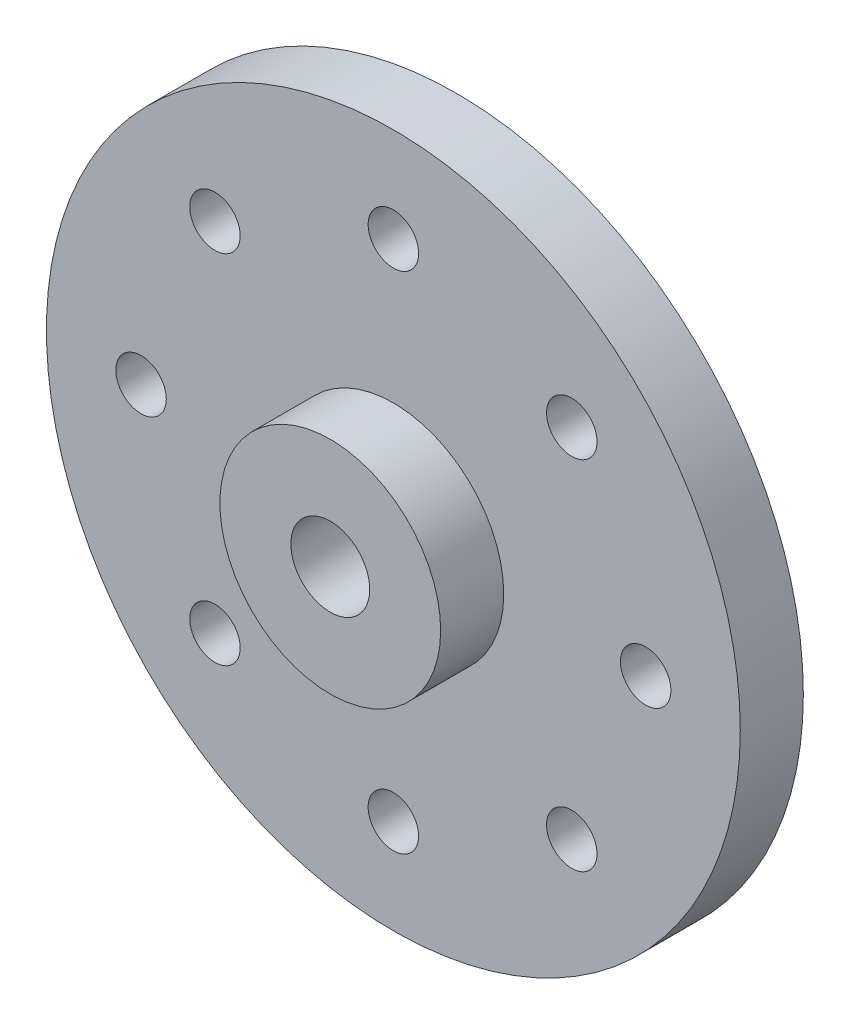
ISO-10303-21;
HEADER;
FILE_DESCRIPTION(('STEP AP214'),'2;1');
FILE_NAME('part.step','',(''),(''),'','','');
FILE_SCHEMA(('AUTOMOTIVE_DESIGN { 1 0 10303 214 1 1 1 1 }'));
ENDSEC;
DATA;
#1=APPLICATION_CONTEXT('core data for automotive mechanical design processes');
#2=APPLICATION_PROTOCOL_DEFINITION('international standard','automotive_design',2000,#1);
#3=PRODUCT_CONTEXT('',#1,'mechanical');
#4=PRODUCT('Part','Part','',(#3));
#5=PRODUCT_RELATED_PRODUCT_CATEGORY('part','',(#4));
#6=PRODUCT_DEFINITION_FORMATION('','',#4);
#7=PRODUCT_DEFINITION_CONTEXT('part definition',#1,'design');
#8=PRODUCT_DEFINITION('design','',#6,#7);
#9=PRODUCT_DEFINITION_SHAPE('','',#8);
#10=(LENGTH_UNIT() NAMED_UNIT(*) SI_UNIT(.MILLI.,.METRE.));
#11=(NAMED_UNIT(*) PLANE_ANGLE_UNIT() SI_UNIT($,.RADIAN.));
#12=(NAMED_UNIT(*) SI_UNIT($,.STERADIAN.) SOLID_ANGLE_UNIT());
#13=UNCERTAINTY_MEASURE_WITH_UNIT(LENGTH_MEASURE(1.E-05),#10,'distance_accuracy_value','');
#14=(GEOMETRIC_REPRESENTATION_CONTEXT(3) GLOBAL_UNCERTAINTY_ASSIGNED_CONTEXT((#13)) GLOBAL_UNIT_ASSIGNED_CONTEXT((#10,
#11,#12)) REPRESENTATION_CONTEXT('',''));
#15=CARTESIAN_POINT('',(0.,0.,0.));
#16=DIRECTION('',(0.,0.,1.));
#17=DIRECTION('',(1.,0.,0.));
#18=AXIS2_PLACEMENT_3D('',#15,#16,#17);
#19=CARTESIAN_POINT('',(0.,0.,0.));
#20=DIRECTION('',(0.,0.,1.));
#21=DIRECTION('',(1.,0.,0.));
#22=AXIS2_PLACEMENT_3D('',#19,#20,#21);
#23=PLANE('',#22);
#24=CARTESIAN_POINT('',(0.,0.,0.));
#25=DIRECTION('',(0.,0.,1.));
#26=DIRECTION('',(1.,0.,0.));
#27=AXIS2_PLACEMENT_3D('',#24,#25,#26);
#28=CIRCLE('',#27,11.);
#29=CARTESIAN_POINT('',(11.,0.,0.));
#30=VERTEX_POINT('',#29);
#31=EDGE_CURVE('E66',#30,#30,#28,.T.);
#32=ORIENTED_EDGE('',*,*,#31,.F.);
#33=EDGE_LOOP('',(#32));
#34=FACE_BOUND('',#33,.T.);
#35=CARTESIAN_POINT('',(5.65685424949239,5.65685424949237,0.));
#36=DIRECTION('',(0.,0.,1.));
#37=DIRECTION('',(1.,0.,0.));
#38=AXIS2_PLACEMENT_3D('',#35,#36,#37);
#39=CIRCLE('',#38,0.799999999999989);
#40=CARTESIAN_POINT('',(6.45685424949238,5.65685424949237,0.));
#41=VERTEX_POINT('',#40);
#42=EDGE_CURVE('E79',#41,#41,#39,.T.);
#43=ORIENTED_EDGE('',*,*,#42,.T.);
#44=EDGE_LOOP('',(#43));
#45=FACE_BOUND('',#44,.T.);
#46=CARTESIAN_POINT('',(8.,0.,0.));
#47=DIRECTION('',(0.,0.,1.));
#48=DIRECTION('',(1.,0.,0.));
#49=AXIS2_PLACEMENT_3D('',#46,#47,#48);
#50=CIRCLE('',#49,0.799999999999989);
#51=CARTESIAN_POINT('',(8.79999999999999,0.,0.));
#52=VERTEX_POINT('',#51);
#53=EDGE_CURVE('E145',#52,#52,#50,.T.);
#54=ORIENTED_EDGE('',*,*,#53,.T.);
#55=EDGE_LOOP('',(#54));
#56=FACE_BOUND('',#55,.T.);
#57=CARTESIAN_POINT('',(5.65685424949235,-5.65685424949241,0.));
#58=DIRECTION('',(0.,0.,1.));
#59=DIRECTION('',(1.,0.,0.));
#60=AXIS2_PLACEMENT_3D('',#57,#58,#59);
#61=CIRCLE('',#60,0.799999999999989);
#62=CARTESIAN_POINT('',(6.45685424949234,-5.65685424949241,0.));
#63=VERTEX_POINT('',#62);
#64=EDGE_CURVE('E84',#63,#63,#61,.T.);
#65=ORIENTED_EDGE('',*,*,#64,.T.);
#66=EDGE_LOOP('',(#65));
#67=FACE_BOUND('',#66,.T.);
#68=CARTESIAN_POINT('',(0.,-8.,0.));
#69=DIRECTION('',(0.,0.,1.));
#70=DIRECTION('',(1.,0.,0.));
#71=AXIS2_PLACEMENT_3D('',#68,#69,#70);
#72=CIRCLE('',#71,0.799999999999989);
#73=CARTESIAN_POINT('',(0.799999999999933,-8.,0.));
#74=VERTEX_POINT('',#73);
#75=EDGE_CURVE('E135',#74,#74,#72,.T.);
#76=ORIENTED_EDGE('',*,*,#75,.T.);
#77=EDGE_LOOP('',(#76));
#78=FACE_BOUND('',#77,.T.);
#79=CARTESIAN_POINT('',(-5.65685424949243,-5.65685424949233,0.));
#80=DIRECTION('',(0.,0.,1.));
#81=DIRECTION('',(1.,0.,0.));
#82=AXIS2_PLACEMENT_3D('',#79,#80,#81);
#83=CIRCLE('',#82,0.799999999999989);
#84=CARTESIAN_POINT('',(-4.85685424949244,-5.65685424949233,0.));
#85=VERTEX_POINT('',#84);
#86=EDGE_CURVE('E90',#85,#85,#83,.T.);
#87=ORIENTED_EDGE('',*,*,#86,.T.);
#88=EDGE_LOOP('',(#87));
#89=FACE_BOUND('',#88,.T.);
#90=CARTESIAN_POINT('',(-8.,0.,0.));
#91=DIRECTION('',(0.,0.,1.));
#92=DIRECTION('',(1.,0.,0.));
#93=AXIS2_PLACEMENT_3D('',#90,#91,#92);
#94=CIRCLE('',#93,0.799999999999989);
#95=CARTESIAN_POINT('',(-7.20000000000001,0.,0.));
#96=VERTEX_POINT('',#95);
#97=EDGE_CURVE('E95',#96,#96,#94,.T.);
#98=ORIENTED_EDGE('',*,*,#97,.T.);
#99=EDGE_LOOP('',(#98));
#100=FACE_BOUND('',#99,.T.);
#101=CARTESIAN_POINT('',(-5.65685424949231,5.65685424949245,0.));
#102=DIRECTION('',(0.,0.,1.));
#103=DIRECTION('',(1.,0.,0.));
#104=AXIS2_PLACEMENT_3D('',#101,#102,#103);
#105=CIRCLE('',#104,0.799999999999989);
#106=CARTESIAN_POINT('',(-4.85685424949232,5.65685424949245,0.));
#107=VERTEX_POINT('',#106);
#108=EDGE_CURVE('E100',#107,#107,#105,.T.);
#109=ORIENTED_EDGE('',*,*,#108,.T.);
#110=EDGE_LOOP('',(#109));
#111=FACE_BOUND('',#110,.T.);
#112=CARTESIAN_POINT('',(0.,8.,0.));
#113=DIRECTION('',(0.,0.,1.));
#114=DIRECTION('',(1.,0.,0.));
#115=AXIS2_PLACEMENT_3D('',#112,#113,#114);
#116=CIRCLE('',#115,0.799999999999989);
#117=CARTESIAN_POINT('',(0.799999999999989,8.,0.));
#118=VERTEX_POINT('',#117);
#119=EDGE_CURVE('E104',#118,#118,#116,.T.);
#120=ORIENTED_EDGE('',*,*,#119,.T.);
#121=EDGE_LOOP('',(#120));
#122=FACE_BOUND('',#121,.T.);
#123=CARTESIAN_POINT('',(0.,0.,0.));
#124=DIRECTION('',(0.,0.,1.));
#125=DIRECTION('',(1.,0.,0.));
#126=AXIS2_PLACEMENT_3D('',#123,#124,#125);
#127=CIRCLE('',#126,2.);
#128=CARTESIAN_POINT('',(2.,0.,0.));
#129=VERTEX_POINT('',#128);
#130=EDGE_CURVE('E12',#129,#129,#127,.F.);
#131=ORIENTED_EDGE('',*,*,#130,.F.);
#132=EDGE_LOOP('',(#131));
#133=FACE_BOUND('',#132,.T.);
#134=ADVANCED_FACE('F52',(#34,#45,#56,#67,#78,#89,#100,#111,#122,#133),#23,.F.);
#135=CARTESIAN_POINT('',(0.,0.,2.));
#136=DIRECTION('',(0.,0.,1.));
#137=DIRECTION('',(1.,0.,0.));
#138=AXIS2_PLACEMENT_3D('',#135,#136,#137);
#139=PLANE('',#138);
#140=CARTESIAN_POINT('',(0.,8.,2.));
#141=DIRECTION('',(0.,0.,1.));
#142=DIRECTION('',(1.,0.,0.));
#143=AXIS2_PLACEMENT_3D('',#140,#141,#142);
#144=CIRCLE('',#143,0.79999999999999);
#145=CARTESIAN_POINT('',(0.79999999999999,8.,2.));
#146=VERTEX_POINT('',#145);
#147=EDGE_CURVE('E107',#146,#146,#144,.T.);
#148=ORIENTED_EDGE('',*,*,#147,.F.);
#149=EDGE_LOOP('',(#148));
#150=FACE_BOUND('',#149,.T.);
#151=CARTESIAN_POINT('',(-5.65685424949231,5.65685424949245,2.));
#152=DIRECTION('',(0.,0.,1.));
#153=DIRECTION('',(1.,0.,0.));
#154=AXIS2_PLACEMENT_3D('',#151,#152,#153);
#155=CIRCLE('',#154,0.79999999999999);
#156=CARTESIAN_POINT('',(-4.85685424949232,5.65685424949245,2.));
#157=VERTEX_POINT('',#156);
#158=EDGE_CURVE('E103',#157,#157,#155,.T.);
#159=ORIENTED_EDGE('',*,*,#158,.F.);
#160=EDGE_LOOP('',(#159));
#161=FACE_BOUND('',#160,.T.);
#162=CARTESIAN_POINT('',(-8.,0.,2.));
#163=DIRECTION('',(0.,0.,1.));
#164=DIRECTION('',(1.,0.,0.));
#165=AXIS2_PLACEMENT_3D('',#162,#163,#164);
#166=CIRCLE('',#165,0.79999999999999);
#167=CARTESIAN_POINT('',(-7.20000000000001,0.,2.));
#168=VERTEX_POINT('',#167);
#169=EDGE_CURVE('E99',#168,#168,#166,.T.);
#170=ORIENTED_EDGE('',*,*,#169,.F.);
#171=EDGE_LOOP('',(#170));
#172=FACE_BOUND('',#171,.T.);
#173=CARTESIAN_POINT('',(-5.65685424949243,-5.65685424949233,2.));
#174=DIRECTION('',(0.,0.,1.));
#175=DIRECTION('',(1.,0.,0.));
#176=AXIS2_PLACEMENT_3D('',#173,#174,#175);
#177=CIRCLE('',#176,0.79999999999999);
#178=CARTESIAN_POINT('',(-4.85685424949244,-5.65685424949233,2.));
#179=VERTEX_POINT('',#178);
#180=EDGE_CURVE('E94',#179,#179,#177,.T.);
#181=ORIENTED_EDGE('',*,*,#180,.F.);
#182=EDGE_LOOP('',(#181));
#183=FACE_BOUND('',#182,.T.);
#184=CARTESIAN_POINT('',(0.,-8.,2.));
#185=DIRECTION('',(0.,0.,1.));
#186=DIRECTION('',(1.,0.,0.));
#187=AXIS2_PLACEMENT_3D('',#184,#185,#186);
#188=CIRCLE('',#187,0.79999999999999);
#189=CARTESIAN_POINT('',(0.799999999999934,-8.,2.));
#190=VERTEX_POINT('',#189);
#191=EDGE_CURVE('E93',#190,#190,#188,.T.);
#192=ORIENTED_EDGE('',*,*,#191,.F.);
#193=EDGE_LOOP('',(#192));
#194=FACE_BOUND('',#193,.T.);
#195=CARTESIAN_POINT('',(5.65685424949235,-5.65685424949241,2.));
#196=DIRECTION('',(0.,0.,1.));
#197=DIRECTION('',(1.,0.,0.));
#198=AXIS2_PLACEMENT_3D('',#195,#196,#197);
#199=CIRCLE('',#198,0.79999999999999);
#200=CARTESIAN_POINT('',(6.45685424949234,-5.65685424949241,2.));
#201=VERTEX_POINT('',#200);
#202=EDGE_CURVE('E89',#201,#201,#199,.T.);
#203=ORIENTED_EDGE('',*,*,#202,.F.);
#204=EDGE_LOOP('',(#203));
#205=FACE_BOUND('',#204,.T.);
#206=CARTESIAN_POINT('',(8.,0.,2.));
#207=DIRECTION('',(0.,0.,1.));
#208=DIRECTION('',(1.,0.,0.));
#209=AXIS2_PLACEMENT_3D('',#206,#207,#208);
#210=CIRCLE('',#209,0.79999999999999);
#211=CARTESIAN_POINT('',(8.79999999999999,0.,2.));
#212=VERTEX_POINT('',#211);
#213=EDGE_CURVE('E88',#212,#212,#210,.T.);
#214=ORIENTED_EDGE('',*,*,#213,.F.);
#215=EDGE_LOOP('',(#214));
#216=FACE_BOUND('',#215,.T.);
#217=CARTESIAN_POINT('',(5.65685424949239,5.65685424949237,2.));
#218=DIRECTION('',(0.,0.,1.));
#219=DIRECTION('',(1.,0.,0.));
#220=AXIS2_PLACEMENT_3D('',#217,#218,#219);
#221=CIRCLE('',#220,0.79999999999999);
#222=CARTESIAN_POINT('',(6.45685424949238,5.65685424949237,2.));
#223=VERTEX_POINT('',#222);
#224=EDGE_CURVE('E83',#223,#223,#221,.T.);
#225=ORIENTED_EDGE('',*,*,#224,.F.);
#226=EDGE_LOOP('',(#225));
#227=FACE_BOUND('',#226,.T.);
#228=CARTESIAN_POINT('',(0.,0.,2.));
#229=DIRECTION('',(0.,0.,1.));
#230=DIRECTION('',(1.,0.,0.));
#231=AXIS2_PLACEMENT_3D('',#228,#229,#230);
#232=CIRCLE('',#231,11.);
#233=CARTESIAN_POINT('',(11.,0.,2.));
#234=VERTEX_POINT('',#233);
#235=EDGE_CURVE('E60',#234,#234,#232,.T.);
#236=ORIENTED_EDGE('',*,*,#235,.T.);
#237=EDGE_LOOP('',(#236));
#238=FACE_BOUND('',#237,.T.);
#239=CARTESIAN_POINT('',(0.,0.,2.));
#240=DIRECTION('',(0.,0.,1.));
#241=DIRECTION('',(1.,0.,0.));
#242=AXIS2_PLACEMENT_3D('',#239,#240,#241);
#243=CIRCLE('',#242,3.5);
#244=CARTESIAN_POINT('',(3.5,0.,2.));
#245=VERTEX_POINT('',#244);
#246=EDGE_CURVE('E76',#245,#245,#243,.T.);
#247=ORIENTED_EDGE('',*,*,#246,.F.);
#248=EDGE_LOOP('',(#247));
#249=FACE_BOUND('',#248,.T.);
#250=ADVANCED_FACE('F160',(#150,#161,#172,#183,#194,#205,#216,#227,#238,#249),#139,.T.);
#251=CARTESIAN_POINT('',(0.,0.,2.));
#252=DIRECTION('',(0.,0.,-1.));
#253=DIRECTION('',(-1.,0.,0.));
#254=AXIS2_PLACEMENT_3D('',#251,#252,#253);
#255=CYLINDRICAL_SURFACE('',#254,11.);
#256=ORIENTED_EDGE('',*,*,#235,.F.);
#257=EDGE_LOOP('',(#256));
#258=FACE_BOUND('',#257,.T.);
#259=ORIENTED_EDGE('',*,*,#31,.T.);
#260=EDGE_LOOP('',(#259));
#261=FACE_BOUND('',#260,.T.);
#262=ADVANCED_FACE('F54',(#258,#261),#255,.T.);
#263=CARTESIAN_POINT('',(0.,0.,4.));
#264=DIRECTION('',(0.,0.,-1.));
#265=DIRECTION('',(-1.,0.,0.));
#266=AXIS2_PLACEMENT_3D('',#263,#264,#265);
#267=CYLINDRICAL_SURFACE('',#266,3.5);
#268=CARTESIAN_POINT('',(0.,0.,4.));
#269=DIRECTION('',(0.,0.,1.));
#270=DIRECTION('',(1.,0.,0.));
#271=AXIS2_PLACEMENT_3D('',#268,#269,#270);
#272=CIRCLE('',#271,3.5);
#273=CARTESIAN_POINT('',(3.5,0.,4.));
#274=VERTEX_POINT('',#273);
#275=EDGE_CURVE('E73',#274,#274,#272,.T.);
#276=ORIENTED_EDGE('',*,*,#275,.F.);
#277=EDGE_LOOP('',(#276));
#278=FACE_BOUND('',#277,.T.);
#279=ORIENTED_EDGE('',*,*,#246,.T.);
#280=EDGE_LOOP('',(#279));
#281=FACE_BOUND('',#280,.T.);
#282=ADVANCED_FACE('F158',(#278,#281),#267,.T.);
#283=CARTESIAN_POINT('',(0.,0.,4.));
#284=DIRECTION('',(0.,0.,1.));
#285=DIRECTION('',(1.,0.,0.));
#286=AXIS2_PLACEMENT_3D('',#283,#284,#285);
#287=PLANE('',#286);
#288=CARTESIAN_POINT('',(0.,0.,4.));
#289=DIRECTION('',(0.,0.,1.));
#290=DIRECTION('',(1.,0.,0.));
#291=AXIS2_PLACEMENT_3D('',#288,#289,#290);
#292=CIRCLE('',#291,1.25);
#293=CARTESIAN_POINT('',(1.25,0.,4.));
#294=VERTEX_POINT('',#293);
#295=EDGE_CURVE('E228',#294,#294,#292,.T.);
#296=ORIENTED_EDGE('',*,*,#295,.F.);
#297=EDGE_LOOP('',(#296));
#298=FACE_BOUND('',#297,.T.);
#299=ORIENTED_EDGE('',*,*,#275,.T.);
#300=EDGE_LOOP('',(#299));
#301=FACE_BOUND('',#300,.T.);
#302=ADVANCED_FACE('F174',(#298,#301),#287,.T.);
#303=CARTESIAN_POINT('',(5.65685424949239,5.65685424949237,2.));
#304=DIRECTION('',(0.,0.,1.));
#305=DIRECTION('',(1.,0.,0.));
#306=AXIS2_PLACEMENT_3D('',#303,#304,#305);
#307=CYLINDRICAL_SURFACE('',#306,0.799999999999989);
#308=ORIENTED_EDGE('',*,*,#224,.T.);
#309=EDGE_LOOP('',(#308));
#310=FACE_BOUND('',#309,.T.);
#311=ORIENTED_EDGE('',*,*,#42,.F.);
#312=EDGE_LOOP('',(#311));
#313=FACE_BOUND('',#312,.T.);
#314=ADVANCED_FACE('F178',(#310,#313),#307,.F.);
#315=CARTESIAN_POINT('',(8.,0.,2.));
#316=DIRECTION('',(0.,0.,1.));
#317=DIRECTION('',(1.,0.,0.));
#318=AXIS2_PLACEMENT_3D('',#315,#316,#317);
#319=CYLINDRICAL_SURFACE('',#318,0.799999999999989);
#320=ORIENTED_EDGE('',*,*,#213,.T.);
#321=EDGE_LOOP('',(#320));
#322=FACE_BOUND('',#321,.T.);
#323=ORIENTED_EDGE('',*,*,#53,.F.);
#324=EDGE_LOOP('',(#323));
#325=FACE_BOUND('',#324,.T.);
#326=ADVANCED_FACE('F182',(#322,#325),#319,.F.);
#327=CARTESIAN_POINT('',(5.65685424949235,-5.65685424949241,2.));
#328=DIRECTION('',(0.,0.,1.));
#329=DIRECTION('',(1.,0.,0.));
#330=AXIS2_PLACEMENT_3D('',#327,#328,#329);
#331=CYLINDRICAL_SURFACE('',#330,0.799999999999989);
#332=ORIENTED_EDGE('',*,*,#202,.T.);
#333=EDGE_LOOP('',(#332));
#334=FACE_BOUND('',#333,.T.);
#335=ORIENTED_EDGE('',*,*,#64,.F.);
#336=EDGE_LOOP('',(#335));
#337=FACE_BOUND('',#336,.T.);
#338=ADVANCED_FACE('F186',(#334,#337),#331,.F.);
#339=CARTESIAN_POINT('',(0.,-8.,2.));
#340=DIRECTION('',(0.,0.,1.));
#341=DIRECTION('',(1.,0.,0.));
#342=AXIS2_PLACEMENT_3D('',#339,#340,#341);
#343=CYLINDRICAL_SURFACE('',#342,0.799999999999989);
#344=ORIENTED_EDGE('',*,*,#191,.T.);
#345=EDGE_LOOP('',(#344));
#346=FACE_BOUND('',#345,.T.);
#347=ORIENTED_EDGE('',*,*,#75,.F.);
#348=EDGE_LOOP('',(#347));
#349=FACE_BOUND('',#348,.T.);
#350=ADVANCED_FACE('F190',(#346,#349),#343,.F.);
#351=CARTESIAN_POINT('',(-5.65685424949243,-5.65685424949233,2.));
#352=DIRECTION('',(0.,0.,1.));
#353=DIRECTION('',(1.,0.,0.));
#354=AXIS2_PLACEMENT_3D('',#351,#352,#353);
#355=CYLINDRICAL_SURFACE('',#354,0.799999999999989);
#356=ORIENTED_EDGE('',*,*,#180,.T.);
#357=EDGE_LOOP('',(#356));
#358=FACE_BOUND('',#357,.T.);
#359=ORIENTED_EDGE('',*,*,#86,.F.);
#360=EDGE_LOOP('',(#359));
#361=FACE_BOUND('',#360,.T.);
#362=ADVANCED_FACE('F194',(#358,#361),#355,.F.);
#363=CARTESIAN_POINT('',(-8.,0.,2.));
#364=DIRECTION('',(0.,0.,1.));
#365=DIRECTION('',(1.,0.,0.));
#366=AXIS2_PLACEMENT_3D('',#363,#364,#365);
#367=CYLINDRICAL_SURFACE('',#366,0.799999999999989);
#368=ORIENTED_EDGE('',*,*,#169,.T.);
#369=EDGE_LOOP('',(#368));
#370=FACE_BOUND('',#369,.T.);
#371=ORIENTED_EDGE('',*,*,#97,.F.);
#372=EDGE_LOOP('',(#371));
#373=FACE_BOUND('',#372,.T.);
#374=ADVANCED_FACE('F198',(#370,#373),#367,.F.);
#375=CARTESIAN_POINT('',(-5.65685424949231,5.65685424949245,2.));
#376=DIRECTION('',(0.,0.,1.));
#377=DIRECTION('',(1.,0.,0.));
#378=AXIS2_PLACEMENT_3D('',#375,#376,#377);
#379=CYLINDRICAL_SURFACE('',#378,0.799999999999989);
#380=ORIENTED_EDGE('',*,*,#158,.T.);
#381=EDGE_LOOP('',(#380));
#382=FACE_BOUND('',#381,.T.);
#383=ORIENTED_EDGE('',*,*,#108,.F.);
#384=EDGE_LOOP('',(#383));
#385=FACE_BOUND('',#384,.T.);
#386=ADVANCED_FACE('F202',(#382,#385),#379,.F.);
#387=CARTESIAN_POINT('',(0.,8.,2.));
#388=DIRECTION('',(0.,0.,1.));
#389=DIRECTION('',(1.,0.,0.));
#390=AXIS2_PLACEMENT_3D('',#387,#388,#389);
#391=CYLINDRICAL_SURFACE('',#390,0.799999999999989);
#392=ORIENTED_EDGE('',*,*,#147,.T.);
#393=EDGE_LOOP('',(#392));
#394=FACE_BOUND('',#393,.T.);
#395=ORIENTED_EDGE('',*,*,#119,.F.);
#396=EDGE_LOOP('',(#395));
#397=FACE_BOUND('',#396,.T.);
#398=ADVANCED_FACE('F206',(#394,#397),#391,.F.);
#399=CARTESIAN_POINT('',(0.,0.,-1.));
#400=DIRECTION('',(0.,0.,-1.));
#401=DIRECTION('',(-1.,0.,0.));
#402=AXIS2_PLACEMENT_3D('',#399,#400,#401);
#403=PLANE('',#402);
#404=CARTESIAN_POINT('',(0.,0.,-1.));
#405=DIRECTION('',(0.,0.,-1.));
#406=DIRECTION('',(-1.,0.,0.));
#407=AXIS2_PLACEMENT_3D('',#404,#405,#406);
#408=CIRCLE('',#407,2.);
#409=CARTESIAN_POINT('',(-2.,0.,-1.));
#410=VERTEX_POINT('',#409);
#411=EDGE_CURVE('E116',#410,#410,#408,.T.);
#412=ORIENTED_EDGE('',*,*,#411,.T.);
#413=EDGE_LOOP('',(#412));
#414=FACE_BOUND('',#413,.T.);
#415=CARTESIAN_POINT('',(0.,0.,-1.));
#416=DIRECTION('',(0.,0.,-1.));
#417=DIRECTION('',(-1.,0.,0.));
#418=AXIS2_PLACEMENT_3D('',#415,#416,#417);
#419=CIRCLE('',#418,1.25);
#420=CARTESIAN_POINT('',(-1.25,0.,-1.));
#421=VERTEX_POINT('',#420);
#422=EDGE_CURVE('E123',#421,#421,#419,.T.);
#423=ORIENTED_EDGE('',*,*,#422,.F.);
#424=EDGE_LOOP('',(#423));
#425=FACE_BOUND('',#424,.T.);
#426=ADVANCED_FACE('F210',(#414,#425),#403,.T.);
#427=CARTESIAN_POINT('',(0.,0.,-1.));
#428=DIRECTION('',(0.,0.,1.));
#429=DIRECTION('',(1.,0.,0.));
#430=AXIS2_PLACEMENT_3D('',#427,#428,#429);
#431=CYLINDRICAL_SURFACE('',#430,2.);
#432=ORIENTED_EDGE('',*,*,#411,.F.);
#433=EDGE_LOOP('',(#432));
#434=FACE_BOUND('',#433,.T.);
#435=ORIENTED_EDGE('',*,*,#130,.T.);
#436=EDGE_LOOP('',(#435));
#437=FACE_BOUND('',#436,.T.);
#438=ADVANCED_FACE('F211',(#434,#437),#431,.T.);
#439=CARTESIAN_POINT('',(0.,0.,-1.));
#440=DIRECTION('',(0.,0.,1.));
#441=DIRECTION('',(1.,0.,0.));
#442=AXIS2_PLACEMENT_3D('',#439,#440,#441);
#443=CYLINDRICAL_SURFACE('',#442,1.25);
#444=ORIENTED_EDGE('',*,*,#422,.T.);
#445=EDGE_LOOP('',(#444));
#446=FACE_BOUND('',#445,.T.);
#447=ORIENTED_EDGE('',*,*,#295,.T.);
#448=EDGE_LOOP('',(#447));
#449=FACE_BOUND('',#448,.T.);
#450=ADVANCED_FACE('F214',(#446,#449),#443,.F.);
#451=CLOSED_SHELL('',(#134,#250,#262,#282,#302,#314,#326,#338,#350,#362,#374,#386,#398,#426,
#438,#450));
#452=MANIFOLD_SOLID_BREP('B2',#451);
#453=ADVANCED_BREP_SHAPE_REPRESENTATION('',(#18,#452),#14);
#454=SHAPE_DEFINITION_REPRESENTATION(#9,#453);
ENDSEC;
END-ISO-10303-21;
